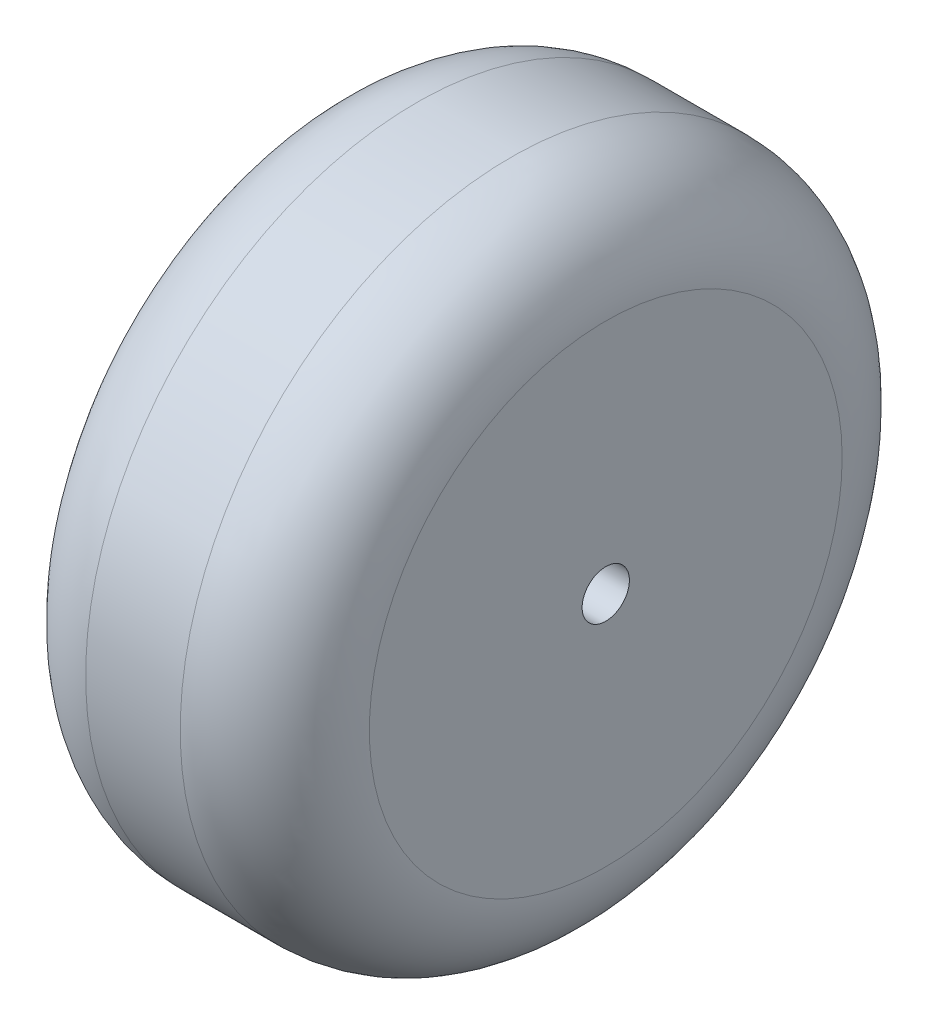
ISO-10303-21;
HEADER;
FILE_DESCRIPTION(('STEP AP214'),'2;1');
FILE_NAME('part.step','',(''),(''),'','','');
FILE_SCHEMA(('AUTOMOTIVE_DESIGN { 1 0 10303 214 1 1 1 1 }'));
ENDSEC;
DATA;
#1=APPLICATION_CONTEXT('core data for automotive mechanical design processes');
#2=APPLICATION_PROTOCOL_DEFINITION('international standard','automotive_design',2000,#1);
#3=PRODUCT_CONTEXT('',#1,'mechanical');
#4=PRODUCT('Part','Part','',(#3));
#5=PRODUCT_RELATED_PRODUCT_CATEGORY('part','',(#4));
#6=PRODUCT_DEFINITION_FORMATION('','',#4);
#7=PRODUCT_DEFINITION_CONTEXT('part definition',#1,'design');
#8=PRODUCT_DEFINITION('design','',#6,#7);
#9=PRODUCT_DEFINITION_SHAPE('','',#8);
#10=(LENGTH_UNIT() NAMED_UNIT(*) SI_UNIT(.MILLI.,.METRE.));
#11=(NAMED_UNIT(*) PLANE_ANGLE_UNIT() SI_UNIT($,.RADIAN.));
#12=(NAMED_UNIT(*) SI_UNIT($,.STERADIAN.) SOLID_ANGLE_UNIT());
#13=UNCERTAINTY_MEASURE_WITH_UNIT(LENGTH_MEASURE(1.E-05),#10,'distance_accuracy_value','');
#14=(GEOMETRIC_REPRESENTATION_CONTEXT(3) GLOBAL_UNCERTAINTY_ASSIGNED_CONTEXT((#13)) GLOBAL_UNIT_ASSIGNED_CONTEXT((#10,
#11,#12)) REPRESENTATION_CONTEXT('',''));
#15=CARTESIAN_POINT('',(0.,0.,0.));
#16=DIRECTION('',(0.,0.,1.));
#17=DIRECTION('',(1.,0.,0.));
#18=AXIS2_PLACEMENT_3D('',#15,#16,#17);
#19=CARTESIAN_POINT('',(30.,0.,0.));
#20=DIRECTION('',(1.,0.,0.));
#21=DIRECTION('',(0.,0.,-1.));
#22=AXIS2_PLACEMENT_3D('',#19,#20,#21);
#23=PLANE('',#22);
#24=CARTESIAN_POINT('',(30.,0.,0.));
#25=DIRECTION('',(1.,0.,0.));
#26=DIRECTION('',(0.,0.,-1.));
#27=AXIS2_PLACEMENT_3D('',#24,#25,#26);
#28=CIRCLE('',#27,25.);
#29=CARTESIAN_POINT('',(30.,0.,-25.));
#30=VERTEX_POINT('',#29);
#31=EDGE_CURVE('E48',#30,#30,#28,.T.);
#32=ORIENTED_EDGE('',*,*,#31,.T.);
#33=EDGE_LOOP('',(#32));
#34=FACE_BOUND('',#33,.T.);
#35=CARTESIAN_POINT('',(30.,0.,0.));
#36=DIRECTION('',(1.,0.,0.));
#37=DIRECTION('',(0.,0.,-1.));
#38=AXIS2_PLACEMENT_3D('',#35,#36,#37);
#39=CIRCLE('',#38,2.5);
#40=CARTESIAN_POINT('',(30.,0.,-2.5));
#41=VERTEX_POINT('',#40);
#42=EDGE_CURVE('E53',#41,#41,#39,.T.);
#43=ORIENTED_EDGE('',*,*,#42,.F.);
#44=EDGE_LOOP('',(#43));
#45=FACE_BOUND('',#44,.T.);
#46=ADVANCED_FACE('F33',(#34,#45),#23,.T.);
#47=CARTESIAN_POINT('',(0.,0.,0.));
#48=DIRECTION('',(1.,0.,0.));
#49=DIRECTION('',(0.,0.,-1.));
#50=AXIS2_PLACEMENT_3D('',#47,#48,#49);
#51=PLANE('',#50);
#52=CARTESIAN_POINT('',(0.,0.,0.));
#53=DIRECTION('',(1.,0.,0.));
#54=DIRECTION('',(0.,0.,-1.));
#55=AXIS2_PLACEMENT_3D('',#52,#53,#54);
#56=CIRCLE('',#55,25.);
#57=CARTESIAN_POINT('',(0.,0.,-25.));
#58=VERTEX_POINT('',#57);
#59=EDGE_CURVE('E10',#58,#58,#56,.F.);
#60=ORIENTED_EDGE('',*,*,#59,.T.);
#61=EDGE_LOOP('',(#60));
#62=FACE_BOUND('',#61,.T.);
#63=CARTESIAN_POINT('',(0.,0.,0.));
#64=DIRECTION('',(1.,0.,0.));
#65=DIRECTION('',(0.,0.,-1.));
#66=AXIS2_PLACEMENT_3D('',#63,#64,#65);
#67=CIRCLE('',#66,2.5);
#68=CARTESIAN_POINT('',(0.,0.,-2.5));
#69=VERTEX_POINT('',#68);
#70=EDGE_CURVE('E54',#69,#69,#67,.T.);
#71=ORIENTED_EDGE('',*,*,#70,.T.);
#72=EDGE_LOOP('',(#71));
#73=FACE_BOUND('',#72,.T.);
#74=ADVANCED_FACE('F64',(#62,#73),#51,.F.);
#75=CARTESIAN_POINT('',(30.,0.,0.));
#76=DIRECTION('',(-1.,0.,0.));
#77=DIRECTION('',(0.,0.,1.));
#78=AXIS2_PLACEMENT_3D('',#75,#76,#77);
#79=CYLINDRICAL_SURFACE('',#78,35.);
#80=CARTESIAN_POINT('',(20.,0.,0.));
#81=DIRECTION('',(1.,0.,0.));
#82=DIRECTION('',(0.,0.,-1.));
#83=AXIS2_PLACEMENT_3D('',#80,#81,#82);
#84=CIRCLE('',#83,35.);
#85=CARTESIAN_POINT('',(20.,0.,-35.));
#86=VERTEX_POINT('',#85);
#87=EDGE_CURVE('E40',#86,#86,#84,.F.);
#88=ORIENTED_EDGE('',*,*,#87,.T.);
#89=EDGE_LOOP('',(#88));
#90=FACE_BOUND('',#89,.T.);
#91=CARTESIAN_POINT('',(10.,0.,0.));
#92=DIRECTION('',(1.,0.,0.));
#93=DIRECTION('',(0.,0.,-1.));
#94=AXIS2_PLACEMENT_3D('',#91,#92,#93);
#95=CIRCLE('',#94,35.);
#96=CARTESIAN_POINT('',(10.,0.,-35.));
#97=VERTEX_POINT('',#96);
#98=EDGE_CURVE('E44',#97,#97,#95,.T.);
#99=ORIENTED_EDGE('',*,*,#98,.T.);
#100=EDGE_LOOP('',(#99));
#101=FACE_BOUND('',#100,.T.);
#102=ADVANCED_FACE('F70',(#90,#101),#79,.T.);
#103=CARTESIAN_POINT('',(30.,0.,0.));
#104=DIRECTION('',(-1.,0.,0.));
#105=DIRECTION('',(0.,0.,1.));
#106=AXIS2_PLACEMENT_3D('',#103,#104,#105);
#107=CYLINDRICAL_SURFACE('',#106,2.5);
#108=ORIENTED_EDGE('',*,*,#42,.T.);
#109=EDGE_LOOP('',(#108));
#110=FACE_BOUND('',#109,.T.);
#111=ORIENTED_EDGE('',*,*,#70,.F.);
#112=EDGE_LOOP('',(#111));
#113=FACE_BOUND('',#112,.T.);
#114=ADVANCED_FACE('F60',(#110,#113),#107,.F.);
#115=CARTESIAN_POINT('',(20.,0.,0.));
#116=DIRECTION('',(1.,0.,0.));
#117=DIRECTION('',(0.,0.,-1.));
#118=AXIS2_PLACEMENT_3D('',#115,#116,#117);
#119=TOROIDAL_SURFACE('',#118,25.,10.);
#120=ORIENTED_EDGE('',*,*,#87,.F.);
#121=EDGE_LOOP('',(#120));
#122=FACE_BOUND('',#121,.T.);
#123=ORIENTED_EDGE('',*,*,#31,.F.);
#124=EDGE_LOOP('',(#123));
#125=FACE_BOUND('',#124,.T.);
#126=ADVANCED_FACE('F75',(#122,#125),#119,.T.);
#127=CARTESIAN_POINT('',(10.,0.,0.));
#128=DIRECTION('',(1.,0.,0.));
#129=DIRECTION('',(0.,0.,-1.));
#130=AXIS2_PLACEMENT_3D('',#127,#128,#129);
#131=TOROIDAL_SURFACE('',#130,25.,10.);
#132=ORIENTED_EDGE('',*,*,#59,.F.);
#133=EDGE_LOOP('',(#132));
#134=FACE_BOUND('',#133,.T.);
#135=ORIENTED_EDGE('',*,*,#98,.F.);
#136=EDGE_LOOP('',(#135));
#137=FACE_BOUND('',#136,.T.);
#138=ADVANCED_FACE('F35',(#134,#137),#131,.T.);
#139=CLOSED_SHELL('',(#46,#74,#102,#114,#126,#138));
#140=MANIFOLD_SOLID_BREP('B2',#139);
#141=ADVANCED_BREP_SHAPE_REPRESENTATION('',(#18,#140),#14);
#142=SHAPE_DEFINITION_REPRESENTATION(#9,#141);
ENDSEC;
END-ISO-10303-21;
